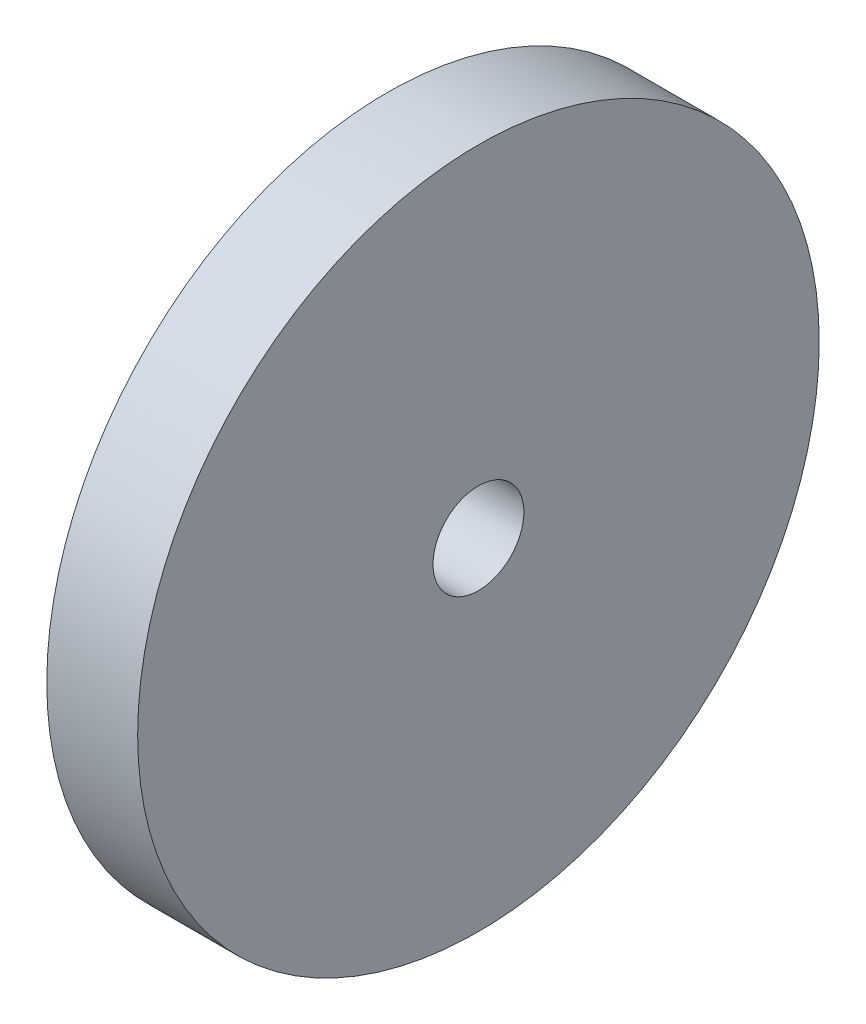
ISO-10303-21;
HEADER;
FILE_DESCRIPTION(('STEP AP214'),'2;1');
FILE_NAME('part.step','',(''),(''),'','','');
FILE_SCHEMA(('AUTOMOTIVE_DESIGN { 1 0 10303 214 1 1 1 1 }'));
ENDSEC;
DATA;
#1=APPLICATION_CONTEXT('core data for automotive mechanical design processes');
#2=APPLICATION_PROTOCOL_DEFINITION('international standard','automotive_design',2000,#1);
#3=PRODUCT_CONTEXT('',#1,'mechanical');
#4=PRODUCT('Part','Part','',(#3));
#5=PRODUCT_RELATED_PRODUCT_CATEGORY('part','',(#4));
#6=PRODUCT_DEFINITION_FORMATION('','',#4);
#7=PRODUCT_DEFINITION_CONTEXT('part definition',#1,'design');
#8=PRODUCT_DEFINITION('design','',#6,#7);
#9=PRODUCT_DEFINITION_SHAPE('','',#8);
#10=(LENGTH_UNIT() NAMED_UNIT(*) SI_UNIT(.MILLI.,.METRE.));
#11=(NAMED_UNIT(*) PLANE_ANGLE_UNIT() SI_UNIT($,.RADIAN.));
#12=(NAMED_UNIT(*) SI_UNIT($,.STERADIAN.) SOLID_ANGLE_UNIT());
#13=UNCERTAINTY_MEASURE_WITH_UNIT(LENGTH_MEASURE(1.E-05),#10,'distance_accuracy_value','');
#14=(GEOMETRIC_REPRESENTATION_CONTEXT(3) GLOBAL_UNCERTAINTY_ASSIGNED_CONTEXT((#13)) GLOBAL_UNIT_ASSIGNED_CONTEXT((#10,
#11,#12)) REPRESENTATION_CONTEXT('',''));
#15=CARTESIAN_POINT('',(0.,0.,0.));
#16=DIRECTION('',(0.,0.,1.));
#17=DIRECTION('',(1.,0.,0.));
#18=AXIS2_PLACEMENT_3D('',#15,#16,#17);
#19=CARTESIAN_POINT('',(8.,0.,0.));
#20=DIRECTION('',(-1.,0.,0.));
#21=DIRECTION('',(0.,0.,-1.));
#22=AXIS2_PLACEMENT_3D('',#19,#20,#21);
#23=CYLINDRICAL_SURFACE('',#22,30.);
#24=CARTESIAN_POINT('',(8.,0.,0.));
#25=DIRECTION('',(-1.,0.,0.));
#26=DIRECTION('',(0.,0.,1.));
#27=AXIS2_PLACEMENT_3D('',#24,#25,#26);
#28=CIRCLE('',#27,30.);
#29=CARTESIAN_POINT('',(8.,0.,30.));
#30=VERTEX_POINT('',#29);
#31=EDGE_CURVE('E10',#30,#30,#28,.T.);
#32=ORIENTED_EDGE('',*,*,#31,.T.);
#33=EDGE_LOOP('',(#32));
#34=FACE_BOUND('',#33,.T.);
#35=CARTESIAN_POINT('',(0.,0.,0.));
#36=DIRECTION('',(-1.,0.,0.));
#37=DIRECTION('',(0.,0.,1.));
#38=AXIS2_PLACEMENT_3D('',#35,#36,#37);
#39=CIRCLE('',#38,30.);
#40=CARTESIAN_POINT('',(0.,0.,30.));
#41=VERTEX_POINT('',#40);
#42=EDGE_CURVE('E40',#41,#41,#39,.T.);
#43=ORIENTED_EDGE('',*,*,#42,.F.);
#44=EDGE_LOOP('',(#43));
#45=FACE_BOUND('',#44,.T.);
#46=ADVANCED_FACE('F37',(#34,#45),#23,.T.);
#47=CARTESIAN_POINT('',(8.,0.,0.));
#48=DIRECTION('',(1.,0.,0.));
#49=DIRECTION('',(0.,0.,1.));
#50=AXIS2_PLACEMENT_3D('',#47,#48,#49);
#51=PLANE('',#50);
#52=CARTESIAN_POINT('',(8.,0.,0.));
#53=DIRECTION('',(-1.,0.,0.));
#54=DIRECTION('',(0.,0.,1.));
#55=AXIS2_PLACEMENT_3D('',#52,#53,#54);
#56=CIRCLE('',#55,4.);
#57=CARTESIAN_POINT('',(8.,0.,4.));
#58=VERTEX_POINT('',#57);
#59=EDGE_CURVE('E49',#58,#58,#56,.T.);
#60=ORIENTED_EDGE('',*,*,#59,.T.);
#61=EDGE_LOOP('',(#60));
#62=FACE_BOUND('',#61,.T.);
#63=ORIENTED_EDGE('',*,*,#31,.F.);
#64=EDGE_LOOP('',(#63));
#65=FACE_BOUND('',#64,.T.);
#66=ADVANCED_FACE('F61',(#62,#65),#51,.T.);
#67=CARTESIAN_POINT('',(0.,0.,0.));
#68=DIRECTION('',(1.,0.,0.));
#69=DIRECTION('',(0.,0.,1.));
#70=AXIS2_PLACEMENT_3D('',#67,#68,#69);
#71=PLANE('',#70);
#72=CARTESIAN_POINT('',(0.,0.,0.));
#73=DIRECTION('',(-1.,0.,0.));
#74=DIRECTION('',(0.,0.,1.));
#75=AXIS2_PLACEMENT_3D('',#72,#73,#74);
#76=CIRCLE('',#75,4.);
#77=CARTESIAN_POINT('',(0.,0.,4.));
#78=VERTEX_POINT('',#77);
#79=EDGE_CURVE('E47',#78,#78,#76,.T.);
#80=ORIENTED_EDGE('',*,*,#79,.F.);
#81=EDGE_LOOP('',(#80));
#82=FACE_BOUND('',#81,.T.);
#83=ORIENTED_EDGE('',*,*,#42,.T.);
#84=EDGE_LOOP('',(#83));
#85=FACE_BOUND('',#84,.T.);
#86=ADVANCED_FACE('F58',(#82,#85),#71,.F.);
#87=CARTESIAN_POINT('',(0.,0.,0.));
#88=DIRECTION('',(1.,0.,0.));
#89=DIRECTION('',(0.,0.,1.));
#90=AXIS2_PLACEMENT_3D('',#87,#88,#89);
#91=CYLINDRICAL_SURFACE('',#90,4.);
#92=ORIENTED_EDGE('',*,*,#79,.T.);
#93=EDGE_LOOP('',(#92));
#94=FACE_BOUND('',#93,.T.);
#95=ORIENTED_EDGE('',*,*,#59,.F.);
#96=EDGE_LOOP('',(#95));
#97=FACE_BOUND('',#96,.T.);
#98=ADVANCED_FACE('F55',(#94,#97),#91,.F.);
#99=CLOSED_SHELL('',(#46,#66,#86,#98));
#100=MANIFOLD_SOLID_BREP('B2',#99);
#101=ADVANCED_BREP_SHAPE_REPRESENTATION('',(#18,#100),#14);
#102=SHAPE_DEFINITION_REPRESENTATION(#9,#101);
ENDSEC;
END-ISO-10303-21;
